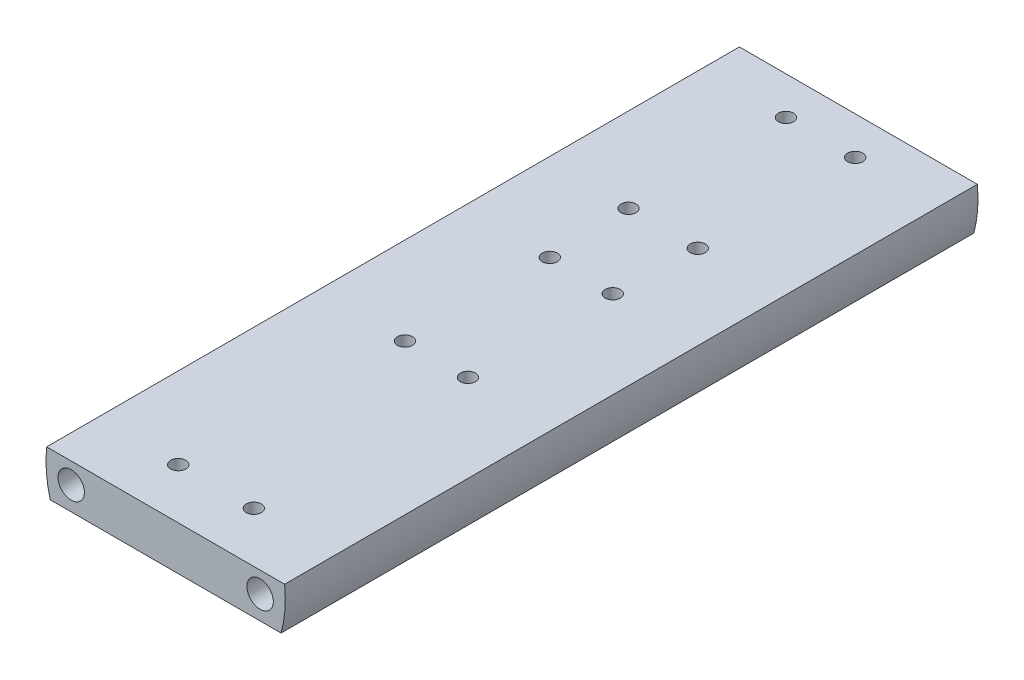
ISO-10303-21;
HEADER;
FILE_DESCRIPTION(('STEP AP214'),'2;1');
FILE_NAME('part.step','',(''),(''),'','','');
FILE_SCHEMA(('AUTOMOTIVE_DESIGN { 1 0 10303 214 1 1 1 1 }'));
ENDSEC;
DATA;
#1=APPLICATION_CONTEXT('core data for automotive mechanical design processes');
#2=APPLICATION_PROTOCOL_DEFINITION('international standard','automotive_design',2000,#1);
#3=PRODUCT_CONTEXT('',#1,'mechanical');
#4=PRODUCT('Part','Part','',(#3));
#5=PRODUCT_RELATED_PRODUCT_CATEGORY('part','',(#4));
#6=PRODUCT_DEFINITION_FORMATION('','',#4);
#7=PRODUCT_DEFINITION_CONTEXT('part definition',#1,'design');
#8=PRODUCT_DEFINITION('design','',#6,#7);
#9=PRODUCT_DEFINITION_SHAPE('','',#8);
#10=(LENGTH_UNIT() NAMED_UNIT(*) SI_UNIT(.MILLI.,.METRE.));
#11=(NAMED_UNIT(*) PLANE_ANGLE_UNIT() SI_UNIT($,.RADIAN.));
#12=(NAMED_UNIT(*) SI_UNIT($,.STERADIAN.) SOLID_ANGLE_UNIT());
#13=UNCERTAINTY_MEASURE_WITH_UNIT(LENGTH_MEASURE(1.E-05),#10,'distance_accuracy_value','');
#14=(GEOMETRIC_REPRESENTATION_CONTEXT(3) GLOBAL_UNCERTAINTY_ASSIGNED_CONTEXT((#13)) GLOBAL_UNIT_ASSIGNED_CONTEXT((#10,
#11,#12)) REPRESENTATION_CONTEXT('',''));
#15=CARTESIAN_POINT('',(0.,0.,0.));
#16=DIRECTION('',(0.,0.,1.));
#17=DIRECTION('',(1.,0.,0.));
#18=AXIS2_PLACEMENT_3D('',#15,#16,#17);
#19=CARTESIAN_POINT('',(0.,-6.35,139.7));
#20=DIRECTION('',(0.,1.,0.));
#21=DIRECTION('',(0.,0.,1.));
#22=AXIS2_PLACEMENT_3D('',#19,#20,#21);
#23=PLANE('',#22);
#24=CARTESIAN_POINT('',(17.7800000000002,-6.35,100.33));
#25=DIRECTION('',(0.,-1.,0.));
#26=DIRECTION('',(0.,0.,-1.));
#27=AXIS2_PLACEMENT_3D('',#24,#25,#26);
#28=CIRCLE('',#27,1.524);
#29=CARTESIAN_POINT('',(17.7800000000002,-6.35,98.806));
#30=VERTEX_POINT('',#29);
#31=EDGE_CURVE('E249',#30,#30,#28,.T.);
#32=ORIENTED_EDGE('',*,*,#31,.F.);
#33=EDGE_LOOP('',(#32));
#34=FACE_BOUND('',#33,.T.);
#35=CARTESIAN_POINT('',(30.4800000000002,-6.35,100.33));
#36=DIRECTION('',(0.,-1.,0.));
#37=DIRECTION('',(0.,0.,-1.));
#38=AXIS2_PLACEMENT_3D('',#35,#36,#37);
#39=CIRCLE('',#38,1.524);
#40=CARTESIAN_POINT('',(30.4800000000002,-6.35,98.806));
#41=VERTEX_POINT('',#40);
#42=EDGE_CURVE('E241',#41,#41,#39,.T.);
#43=ORIENTED_EDGE('',*,*,#42,.F.);
#44=EDGE_LOOP('',(#43));
#45=FACE_BOUND('',#44,.T.);
#46=CARTESIAN_POINT('',(30.48,-6.35,125.73));
#47=DIRECTION('',(0.,-1.,0.));
#48=DIRECTION('',(0.,0.,-1.));
#49=AXIS2_PLACEMENT_3D('',#46,#47,#48);
#50=CIRCLE('',#49,1.524);
#51=CARTESIAN_POINT('',(30.48,-6.35,124.206));
#52=VERTEX_POINT('',#51);
#53=EDGE_CURVE('E233',#52,#52,#50,.T.);
#54=ORIENTED_EDGE('',*,*,#53,.F.);
#55=EDGE_LOOP('',(#54));
#56=FACE_BOUND('',#55,.T.);
#57=CARTESIAN_POINT('',(17.78,-6.35,125.73));
#58=DIRECTION('',(0.,-1.,0.));
#59=DIRECTION('',(0.,0.,-1.));
#60=AXIS2_PLACEMENT_3D('',#57,#58,#59);
#61=CIRCLE('',#60,1.524);
#62=CARTESIAN_POINT('',(17.78,-6.35,124.206));
#63=VERTEX_POINT('',#62);
#64=EDGE_CURVE('E229',#63,#63,#61,.T.);
#65=ORIENTED_EDGE('',*,*,#64,.F.);
#66=EDGE_LOOP('',(#65));
#67=FACE_BOUND('',#66,.T.);
#68=DIRECTION('',(1.,0.,0.));
#69=VECTOR('',#68,1.);
#70=CARTESIAN_POINT('',(0.,-6.35,0.));
#71=LINE('',#70,#69);
#72=CARTESIAN_POINT('',(0.850515469624332,-6.35,0.));
#73=VERTEX_POINT('',#72);
#74=CARTESIAN_POINT('',(47.4094845303757,-6.35,0.));
#75=VERTEX_POINT('',#74);
#76=EDGE_CURVE('E119',#73,#75,#71,.T.);
#77=ORIENTED_EDGE('',*,*,#76,.T.);
#78=DIRECTION('',(0.,0.,-1.));
#79=VECTOR('',#78,1.);
#80=CARTESIAN_POINT('',(47.4094845303757,-6.35,139.7));
#81=LINE('',#80,#79);
#82=CARTESIAN_POINT('',(47.4094845303757,-6.35,139.7));
#83=VERTEX_POINT('',#82);
#84=EDGE_CURVE('E11',#83,#75,#81,.T.);
#85=ORIENTED_EDGE('',*,*,#84,.F.);
#86=DIRECTION('',(1.,0.,0.));
#87=VECTOR('',#86,1.);
#88=CARTESIAN_POINT('',(0.,-6.35,139.7));
#89=LINE('',#88,#87);
#90=CARTESIAN_POINT('',(0.850515469624332,-6.35,139.7));
#91=VERTEX_POINT('',#90);
#92=EDGE_CURVE('E93',#91,#83,#89,.T.);
#93=ORIENTED_EDGE('',*,*,#92,.F.);
#94=DIRECTION('',(0.,0.,-1.));
#95=VECTOR('',#94,1.);
#96=CARTESIAN_POINT('',(0.850515469624332,-6.35,139.7));
#97=LINE('',#96,#95);
#98=EDGE_CURVE('E118',#91,#73,#97,.T.);
#99=ORIENTED_EDGE('',*,*,#98,.T.);
#100=EDGE_LOOP('',(#77,#85,#93,#99));
#101=FACE_BOUND('',#100,.T.);
#102=ADVANCED_FACE('F44',(#34,#45,#56,#67,#101),#23,.F.);
#103=CARTESIAN_POINT('',(24.13,0.,139.7));
#104=DIRECTION('',(0.,0.,-1.));
#105=DIRECTION('',(-1.,0.,0.));
#106=AXIS2_PLACEMENT_3D('',#103,#104,#105);
#107=CYLINDRICAL_SURFACE('',#106,24.13);
#108=CARTESIAN_POINT('',(24.13,0.,0.));
#109=DIRECTION('',(0.,0.,1.));
#110=DIRECTION('',(1.,0.,0.));
#111=AXIS2_PLACEMENT_3D('',#108,#109,#110);
#112=CIRCLE('',#111,24.13);
#113=CARTESIAN_POINT('',(48.1259434071678,2.54,0.));
#114=VERTEX_POINT('',#113);
#115=EDGE_CURVE('E99',#75,#114,#112,.T.);
#116=ORIENTED_EDGE('',*,*,#115,.T.);
#117=DIRECTION('',(0.,0.,-1.));
#118=VECTOR('',#117,1.);
#119=CARTESIAN_POINT('',(48.1259434071678,2.54,139.7));
#120=LINE('',#119,#118);
#121=CARTESIAN_POINT('',(48.1259434071678,2.54,139.7));
#122=VERTEX_POINT('',#121);
#123=EDGE_CURVE('E53',#122,#114,#120,.T.);
#124=ORIENTED_EDGE('',*,*,#123,.F.);
#125=CARTESIAN_POINT('',(24.13,0.,139.7));
#126=DIRECTION('',(0.,0.,1.));
#127=DIRECTION('',(1.,0.,0.));
#128=AXIS2_PLACEMENT_3D('',#125,#126,#127);
#129=CIRCLE('',#128,24.13);
#130=EDGE_CURVE('E87',#83,#122,#129,.T.);
#131=ORIENTED_EDGE('',*,*,#130,.F.);
#132=ORIENTED_EDGE('',*,*,#84,.T.);
#133=EDGE_LOOP('',(#116,#124,#131,#132));
#134=FACE_BOUND('',#133,.T.);
#135=ADVANCED_FACE('F98',(#134),#107,.T.);
#136=CARTESIAN_POINT('',(0.,2.54,139.7));
#137=DIRECTION('',(0.,1.,0.));
#138=DIRECTION('',(0.,0.,1.));
#139=AXIS2_PLACEMENT_3D('',#136,#137,#138);
#140=PLANE('',#139);
#141=CARTESIAN_POINT('',(17.7800000000003,2.54,85.09));
#142=DIRECTION('',(0.,1.,0.));
#143=DIRECTION('',(0.,0.,1.));
#144=AXIS2_PLACEMENT_3D('',#141,#142,#143);
#145=CIRCLE('',#144,1.524);
#146=CARTESIAN_POINT('',(17.7800000000003,2.54,86.614));
#147=VERTEX_POINT('',#146);
#148=EDGE_CURVE('E209',#147,#147,#145,.T.);
#149=ORIENTED_EDGE('',*,*,#148,.F.);
#150=EDGE_LOOP('',(#149));
#151=FACE_BOUND('',#150,.T.);
#152=CARTESIAN_POINT('',(30.4800000000003,2.54,85.09));
#153=DIRECTION('',(0.,1.,0.));
#154=DIRECTION('',(0.,0.,1.));
#155=AXIS2_PLACEMENT_3D('',#152,#153,#154);
#156=CIRCLE('',#155,1.52400000000001);
#157=CARTESIAN_POINT('',(30.4800000000003,2.54,86.614));
#158=VERTEX_POINT('',#157);
#159=EDGE_CURVE('E201',#158,#158,#156,.T.);
#160=ORIENTED_EDGE('',*,*,#159,.F.);
#161=EDGE_LOOP('',(#160));
#162=FACE_BOUND('',#161,.T.);
#163=CARTESIAN_POINT('',(30.48,2.54,55.88));
#164=DIRECTION('',(0.,1.,0.));
#165=DIRECTION('',(0.,0.,1.));
#166=AXIS2_PLACEMENT_3D('',#163,#164,#165);
#167=CIRCLE('',#166,1.52400000000001);
#168=CARTESIAN_POINT('',(30.48,2.54,57.404));
#169=VERTEX_POINT('',#168);
#170=EDGE_CURVE('E193',#169,#169,#167,.T.);
#171=ORIENTED_EDGE('',*,*,#170,.F.);
#172=EDGE_LOOP('',(#171));
#173=FACE_BOUND('',#172,.T.);
#174=CARTESIAN_POINT('',(17.1450000000003,2.54,39.37));
#175=DIRECTION('',(0.,1.,0.));
#176=DIRECTION('',(0.,0.,1.));
#177=AXIS2_PLACEMENT_3D('',#174,#175,#176);
#178=CIRCLE('',#177,1.524);
#179=CARTESIAN_POINT('',(17.1450000000003,2.54,40.894));
#180=VERTEX_POINT('',#179);
#181=EDGE_CURVE('E185',#180,#180,#178,.T.);
#182=ORIENTED_EDGE('',*,*,#181,.F.);
#183=EDGE_LOOP('',(#182));
#184=FACE_BOUND('',#183,.T.);
#185=CARTESIAN_POINT('',(31.1150000000003,2.54,39.37));
#186=DIRECTION('',(0.,1.,0.));
#187=DIRECTION('',(0.,0.,1.));
#188=AXIS2_PLACEMENT_3D('',#185,#186,#187);
#189=CIRCLE('',#188,1.524);
#190=CARTESIAN_POINT('',(31.1150000000003,2.54,40.894));
#191=VERTEX_POINT('',#190);
#192=EDGE_CURVE('E177',#191,#191,#189,.T.);
#193=ORIENTED_EDGE('',*,*,#192,.F.);
#194=EDGE_LOOP('',(#193));
#195=FACE_BOUND('',#194,.T.);
#196=CARTESIAN_POINT('',(31.115,2.54,7.62));
#197=DIRECTION('',(0.,1.,0.));
#198=DIRECTION('',(0.,0.,1.));
#199=AXIS2_PLACEMENT_3D('',#196,#197,#198);
#200=CIRCLE('',#199,1.52400000000001);
#201=CARTESIAN_POINT('',(31.115,2.54,9.144));
#202=VERTEX_POINT('',#201);
#203=EDGE_CURVE('E169',#202,#202,#200,.T.);
#204=ORIENTED_EDGE('',*,*,#203,.F.);
#205=EDGE_LOOP('',(#204));
#206=FACE_BOUND('',#205,.T.);
#207=CARTESIAN_POINT('',(16.5100000000003,2.54,129.54));
#208=DIRECTION('',(0.,1.,0.));
#209=DIRECTION('',(0.,0.,1.));
#210=AXIS2_PLACEMENT_3D('',#207,#208,#209);
#211=CIRCLE('',#210,1.524);
#212=CARTESIAN_POINT('',(16.5100000000003,2.54,131.064));
#213=VERTEX_POINT('',#212);
#214=EDGE_CURVE('E161',#213,#213,#211,.T.);
#215=ORIENTED_EDGE('',*,*,#214,.F.);
#216=EDGE_LOOP('',(#215));
#217=FACE_BOUND('',#216,.T.);
#218=CARTESIAN_POINT('',(17.78,2.54,55.88));
#219=DIRECTION('',(0.,1.,0.));
#220=DIRECTION('',(0.,0.,1.));
#221=AXIS2_PLACEMENT_3D('',#218,#219,#220);
#222=CIRCLE('',#221,1.524);
#223=CARTESIAN_POINT('',(17.78,2.54,57.404));
#224=VERTEX_POINT('',#223);
#225=EDGE_CURVE('E153',#224,#224,#222,.T.);
#226=ORIENTED_EDGE('',*,*,#225,.F.);
#227=EDGE_LOOP('',(#226));
#228=FACE_BOUND('',#227,.T.);
#229=CARTESIAN_POINT('',(31.7500000000003,2.54,129.54));
#230=DIRECTION('',(0.,1.,0.));
#231=DIRECTION('',(0.,0.,1.));
#232=AXIS2_PLACEMENT_3D('',#229,#230,#231);
#233=CIRCLE('',#232,1.524);
#234=CARTESIAN_POINT('',(31.7500000000003,2.54,131.064));
#235=VERTEX_POINT('',#234);
#236=EDGE_CURVE('E217',#235,#235,#233,.T.);
#237=ORIENTED_EDGE('',*,*,#236,.F.);
#238=EDGE_LOOP('',(#237));
#239=FACE_BOUND('',#238,.T.);
#240=CARTESIAN_POINT('',(17.145,2.54,7.62));
#241=DIRECTION('',(0.,1.,0.));
#242=DIRECTION('',(0.,0.,1.));
#243=AXIS2_PLACEMENT_3D('',#240,#241,#242);
#244=CIRCLE('',#243,1.524);
#245=CARTESIAN_POINT('',(17.145,2.54,9.14399999999999));
#246=VERTEX_POINT('',#245);
#247=EDGE_CURVE('E149',#246,#246,#244,.T.);
#248=ORIENTED_EDGE('',*,*,#247,.F.);
#249=EDGE_LOOP('',(#248));
#250=FACE_BOUND('',#249,.T.);
#251=DIRECTION('',(1.,0.,0.));
#252=VECTOR('',#251,1.);
#253=CARTESIAN_POINT('',(0.,2.54,0.));
#254=LINE('',#253,#252);
#255=CARTESIAN_POINT('',(0.134056592832194,2.54,0.));
#256=VERTEX_POINT('',#255);
#257=EDGE_CURVE('E126',#256,#114,#254,.T.);
#258=ORIENTED_EDGE('',*,*,#257,.F.);
#259=DIRECTION('',(0.,0.,-1.));
#260=VECTOR('',#259,1.);
#261=CARTESIAN_POINT('',(0.134056592832194,2.54,139.7));
#262=LINE('',#261,#260);
#263=CARTESIAN_POINT('',(0.134056592832194,2.54,139.7));
#264=VERTEX_POINT('',#263);
#265=EDGE_CURVE('E77',#264,#256,#262,.T.);
#266=ORIENTED_EDGE('',*,*,#265,.F.);
#267=DIRECTION('',(1.,0.,0.));
#268=VECTOR('',#267,1.);
#269=CARTESIAN_POINT('',(0.,2.54,139.7));
#270=LINE('',#269,#268);
#271=EDGE_CURVE('E91',#264,#122,#270,.T.);
#272=ORIENTED_EDGE('',*,*,#271,.T.);
#273=ORIENTED_EDGE('',*,*,#123,.T.);
#274=EDGE_LOOP('',(#258,#266,#272,#273));
#275=FACE_BOUND('',#274,.T.);
#276=ADVANCED_FACE('F104',(#151,#162,#173,#184,#195,#206,#217,#228,#239,#250,#275),#140,.T.);
#277=CARTESIAN_POINT('',(5.08,-1.63488750906681,139.7));
#278=DIRECTION('',(0.,0.,-1.));
#279=DIRECTION('',(-1.,0.,0.));
#280=AXIS2_PLACEMENT_3D('',#277,#278,#279);
#281=CYLINDRICAL_SURFACE('',#280,2.667);
#282=CARTESIAN_POINT('',(5.08,-1.63488750906681,139.7));
#283=DIRECTION('',(0.,0.,1.));
#284=DIRECTION('',(1.,0.,0.));
#285=AXIS2_PLACEMENT_3D('',#282,#283,#284);
#286=CIRCLE('',#285,2.667);
#287=CARTESIAN_POINT('',(7.747,-1.63488750906681,139.7));
#288=VERTEX_POINT('',#287);
#289=EDGE_CURVE('E108',#288,#288,#286,.T.);
#290=ORIENTED_EDGE('',*,*,#289,.T.);
#291=EDGE_LOOP('',(#290));
#292=FACE_BOUND('',#291,.T.);
#293=CARTESIAN_POINT('',(5.08,-1.63488750906681,0.));
#294=DIRECTION('',(0.,0.,1.));
#295=DIRECTION('',(1.,0.,0.));
#296=AXIS2_PLACEMENT_3D('',#293,#294,#295);
#297=CIRCLE('',#296,2.667);
#298=CARTESIAN_POINT('',(7.747,-1.63488750906681,0.));
#299=VERTEX_POINT('',#298);
#300=EDGE_CURVE('E129',#299,#299,#297,.T.);
#301=ORIENTED_EDGE('',*,*,#300,.F.);
#302=EDGE_LOOP('',(#301));
#303=FACE_BOUND('',#302,.T.);
#304=ADVANCED_FACE('F380',(#292,#303),#281,.F.);
#305=EDGE_CURVE('E80',#256,#73,#112,.T.);
#306=ORIENTED_EDGE('',*,*,#305,.T.);
#307=ORIENTED_EDGE('',*,*,#98,.F.);
#308=EDGE_CURVE('E61',#264,#91,#129,.T.);
#309=ORIENTED_EDGE('',*,*,#308,.F.);
#310=ORIENTED_EDGE('',*,*,#265,.T.);
#311=EDGE_LOOP('',(#306,#307,#309,#310));
#312=FACE_BOUND('',#311,.T.);
#313=ADVANCED_FACE('F378',(#312),#107,.T.);
#314=CARTESIAN_POINT('',(43.18,-1.63488750906681,139.7));
#315=DIRECTION('',(0.,0.,-1.));
#316=DIRECTION('',(-1.,0.,0.));
#317=AXIS2_PLACEMENT_3D('',#314,#315,#316);
#318=CYLINDRICAL_SURFACE('',#317,2.667);
#319=CARTESIAN_POINT('',(43.18,-1.63488750906681,139.7));
#320=DIRECTION('',(0.,0.,1.));
#321=DIRECTION('',(1.,0.,0.));
#322=AXIS2_PLACEMENT_3D('',#319,#320,#321);
#323=CIRCLE('',#322,2.667);
#324=CARTESIAN_POINT('',(45.847,-1.63488750906681,139.7));
#325=VERTEX_POINT('',#324);
#326=EDGE_CURVE('E114',#325,#325,#323,.T.);
#327=ORIENTED_EDGE('',*,*,#326,.T.);
#328=EDGE_LOOP('',(#327));
#329=FACE_BOUND('',#328,.T.);
#330=CARTESIAN_POINT('',(43.18,-1.63488750906681,0.));
#331=DIRECTION('',(0.,0.,1.));
#332=DIRECTION('',(1.,0.,0.));
#333=AXIS2_PLACEMENT_3D('',#330,#331,#332);
#334=CIRCLE('',#333,2.667);
#335=CARTESIAN_POINT('',(45.847,-1.63488750906681,0.));
#336=VERTEX_POINT('',#335);
#337=EDGE_CURVE('E133',#336,#336,#334,.T.);
#338=ORIENTED_EDGE('',*,*,#337,.F.);
#339=EDGE_LOOP('',(#338));
#340=FACE_BOUND('',#339,.T.);
#341=ADVANCED_FACE('F373',(#329,#340),#318,.F.);
#342=CARTESIAN_POINT('',(0.,0.,139.7));
#343=DIRECTION('',(0.,0.,1.));
#344=DIRECTION('',(1.,0.,0.));
#345=AXIS2_PLACEMENT_3D('',#342,#343,#344);
#346=PLANE('',#345);
#347=ORIENTED_EDGE('',*,*,#92,.T.);
#348=ORIENTED_EDGE('',*,*,#130,.T.);
#349=ORIENTED_EDGE('',*,*,#271,.F.);
#350=ORIENTED_EDGE('',*,*,#308,.T.);
#351=EDGE_LOOP('',(#347,#348,#349,#350));
#352=FACE_BOUND('',#351,.T.);
#353=ORIENTED_EDGE('',*,*,#289,.F.);
#354=EDGE_LOOP('',(#353));
#355=FACE_BOUND('',#354,.T.);
#356=ORIENTED_EDGE('',*,*,#326,.F.);
#357=EDGE_LOOP('',(#356));
#358=FACE_BOUND('',#357,.T.);
#359=ADVANCED_FACE('F88',(#352,#355,#358),#346,.T.);
#360=CARTESIAN_POINT('',(0.,0.,0.));
#361=DIRECTION('',(0.,0.,1.));
#362=DIRECTION('',(1.,0.,0.));
#363=AXIS2_PLACEMENT_3D('',#360,#361,#362);
#364=PLANE('',#363);
#365=ORIENTED_EDGE('',*,*,#76,.F.);
#366=ORIENTED_EDGE('',*,*,#305,.F.);
#367=ORIENTED_EDGE('',*,*,#257,.T.);
#368=ORIENTED_EDGE('',*,*,#115,.F.);
#369=EDGE_LOOP('',(#365,#366,#367,#368));
#370=FACE_BOUND('',#369,.T.);
#371=ORIENTED_EDGE('',*,*,#300,.T.);
#372=EDGE_LOOP('',(#371));
#373=FACE_BOUND('',#372,.T.);
#374=ORIENTED_EDGE('',*,*,#337,.T.);
#375=EDGE_LOOP('',(#374));
#376=FACE_BOUND('',#375,.T.);
#377=ADVANCED_FACE('F143',(#370,#373,#376),#364,.F.);
#378=CARTESIAN_POINT('',(17.145,-2.54,7.62));
#379=DIRECTION('',(0.,1.,0.));
#380=DIRECTION('',(0.,0.,1.));
#381=AXIS2_PLACEMENT_3D('',#378,#379,#380);
#382=CYLINDRICAL_SURFACE('',#381,1.524);
#383=CARTESIAN_POINT('',(17.145,-2.54,7.62));
#384=DIRECTION('',(0.,1.,0.));
#385=DIRECTION('',(0.,0.,1.));
#386=AXIS2_PLACEMENT_3D('',#383,#384,#385);
#387=CIRCLE('',#386,1.524);
#388=CARTESIAN_POINT('',(17.145,-2.54,9.14399999999999));
#389=VERTEX_POINT('',#388);
#390=EDGE_CURVE('E123',#389,#389,#387,.T.);
#391=ORIENTED_EDGE('',*,*,#390,.F.);
#392=EDGE_LOOP('',(#391));
#393=FACE_BOUND('',#392,.T.);
#394=ORIENTED_EDGE('',*,*,#247,.T.);
#395=EDGE_LOOP('',(#394));
#396=FACE_BOUND('',#395,.T.);
#397=ADVANCED_FACE('F366',(#393,#396),#382,.F.);
#398=CARTESIAN_POINT('',(17.145,-2.54,7.62));
#399=DIRECTION('',(0.,1.,0.));
#400=DIRECTION('',(0.,0.,1.));
#401=AXIS2_PLACEMENT_3D('',#398,#399,#400);
#402=PLANE('',#401);
#403=ORIENTED_EDGE('',*,*,#390,.T.);
#404=EDGE_LOOP('',(#403));
#405=FACE_BOUND('',#404,.T.);
#406=ADVANCED_FACE('F300',(#405),#402,.T.);
#407=CARTESIAN_POINT('',(31.7500000000003,-2.54,129.54));
#408=DIRECTION('',(0.,1.,0.));
#409=DIRECTION('',(0.,0.,1.));
#410=AXIS2_PLACEMENT_3D('',#407,#408,#409);
#411=CYLINDRICAL_SURFACE('',#410,1.524);
#412=CARTESIAN_POINT('',(31.7500000000003,-2.54,129.54));
#413=DIRECTION('',(0.,1.,0.));
#414=DIRECTION('',(0.,0.,1.));
#415=AXIS2_PLACEMENT_3D('',#412,#413,#414);
#416=CIRCLE('',#415,1.524);
#417=CARTESIAN_POINT('',(31.7500000000003,-2.54,131.064));
#418=VERTEX_POINT('',#417);
#419=EDGE_CURVE('E221',#418,#418,#416,.T.);
#420=ORIENTED_EDGE('',*,*,#419,.F.);
#421=EDGE_LOOP('',(#420));
#422=FACE_BOUND('',#421,.T.);
#423=ORIENTED_EDGE('',*,*,#236,.T.);
#424=EDGE_LOOP('',(#423));
#425=FACE_BOUND('',#424,.T.);
#426=ADVANCED_FACE('F296',(#422,#425),#411,.F.);
#427=CARTESIAN_POINT('',(31.7500000000003,-2.54,129.54));
#428=DIRECTION('',(0.,1.,0.));
#429=DIRECTION('',(0.,0.,1.));
#430=AXIS2_PLACEMENT_3D('',#427,#428,#429);
#431=PLANE('',#430);
#432=ORIENTED_EDGE('',*,*,#419,.T.);
#433=EDGE_LOOP('',(#432));
#434=FACE_BOUND('',#433,.T.);
#435=ADVANCED_FACE('F299',(#434),#431,.T.);
#436=CARTESIAN_POINT('',(17.78,-2.54,55.88));
#437=DIRECTION('',(0.,1.,0.));
#438=DIRECTION('',(0.,0.,1.));
#439=AXIS2_PLACEMENT_3D('',#436,#437,#438);
#440=CYLINDRICAL_SURFACE('',#439,1.524);
#441=CARTESIAN_POINT('',(17.78,-2.54,55.88));
#442=DIRECTION('',(0.,1.,0.));
#443=DIRECTION('',(0.,0.,1.));
#444=AXIS2_PLACEMENT_3D('',#441,#442,#443);
#445=CIRCLE('',#444,1.524);
#446=CARTESIAN_POINT('',(17.78,-2.54,57.404));
#447=VERTEX_POINT('',#446);
#448=EDGE_CURVE('E157',#447,#447,#445,.T.);
#449=ORIENTED_EDGE('',*,*,#448,.F.);
#450=EDGE_LOOP('',(#449));
#451=FACE_BOUND('',#450,.T.);
#452=ORIENTED_EDGE('',*,*,#225,.T.);
#453=EDGE_LOOP('',(#452));
#454=FACE_BOUND('',#453,.T.);
#455=ADVANCED_FACE('F304',(#451,#454),#440,.F.);
#456=CARTESIAN_POINT('',(17.78,-2.54,55.88));
#457=DIRECTION('',(0.,1.,0.));
#458=DIRECTION('',(0.,0.,1.));
#459=AXIS2_PLACEMENT_3D('',#456,#457,#458);
#460=PLANE('',#459);
#461=ORIENTED_EDGE('',*,*,#448,.T.);
#462=EDGE_LOOP('',(#461));
#463=FACE_BOUND('',#462,.T.);
#464=ADVANCED_FACE('F336',(#463),#460,.T.);
#465=CARTESIAN_POINT('',(16.5100000000003,-2.54,129.54));
#466=DIRECTION('',(0.,1.,0.));
#467=DIRECTION('',(0.,0.,1.));
#468=AXIS2_PLACEMENT_3D('',#465,#466,#467);
#469=CYLINDRICAL_SURFACE('',#468,1.524);
#470=CARTESIAN_POINT('',(16.5100000000003,-2.54,129.54));
#471=DIRECTION('',(0.,1.,0.));
#472=DIRECTION('',(0.,0.,1.));
#473=AXIS2_PLACEMENT_3D('',#470,#471,#472);
#474=CIRCLE('',#473,1.524);
#475=CARTESIAN_POINT('',(16.5100000000003,-2.54,131.064));
#476=VERTEX_POINT('',#475);
#477=EDGE_CURVE('E165',#476,#476,#474,.T.);
#478=ORIENTED_EDGE('',*,*,#477,.F.);
#479=EDGE_LOOP('',(#478));
#480=FACE_BOUND('',#479,.T.);
#481=ORIENTED_EDGE('',*,*,#214,.T.);
#482=EDGE_LOOP('',(#481));
#483=FACE_BOUND('',#482,.T.);
#484=ADVANCED_FACE('F340',(#480,#483),#469,.F.);
#485=CARTESIAN_POINT('',(16.5100000000003,-2.54,129.54));
#486=DIRECTION('',(0.,1.,0.));
#487=DIRECTION('',(0.,0.,1.));
#488=AXIS2_PLACEMENT_3D('',#485,#486,#487);
#489=PLANE('',#488);
#490=ORIENTED_EDGE('',*,*,#477,.T.);
#491=EDGE_LOOP('',(#490));
#492=FACE_BOUND('',#491,.T.);
#493=ADVANCED_FACE('F344',(#492),#489,.T.);
#494=CARTESIAN_POINT('',(31.115,-2.54,7.62));
#495=DIRECTION('',(0.,1.,0.));
#496=DIRECTION('',(0.,0.,1.));
#497=AXIS2_PLACEMENT_3D('',#494,#495,#496);
#498=CYLINDRICAL_SURFACE('',#497,1.52400000000001);
#499=CARTESIAN_POINT('',(31.115,-2.54,7.62));
#500=DIRECTION('',(0.,1.,0.));
#501=DIRECTION('',(0.,0.,1.));
#502=AXIS2_PLACEMENT_3D('',#499,#500,#501);
#503=CIRCLE('',#502,1.52400000000001);
#504=CARTESIAN_POINT('',(31.115,-2.54,9.144));
#505=VERTEX_POINT('',#504);
#506=EDGE_CURVE('E173',#505,#505,#503,.T.);
#507=ORIENTED_EDGE('',*,*,#506,.F.);
#508=EDGE_LOOP('',(#507));
#509=FACE_BOUND('',#508,.T.);
#510=ORIENTED_EDGE('',*,*,#203,.T.);
#511=EDGE_LOOP('',(#510));
#512=FACE_BOUND('',#511,.T.);
#513=ADVANCED_FACE('F348',(#509,#512),#498,.F.);
#514=CARTESIAN_POINT('',(31.115,-2.54,7.62));
#515=DIRECTION('',(0.,1.,0.));
#516=DIRECTION('',(0.,0.,1.));
#517=AXIS2_PLACEMENT_3D('',#514,#515,#516);
#518=PLANE('',#517);
#519=ORIENTED_EDGE('',*,*,#506,.T.);
#520=EDGE_LOOP('',(#519));
#521=FACE_BOUND('',#520,.T.);
#522=ADVANCED_FACE('F352',(#521),#518,.T.);
#523=CARTESIAN_POINT('',(31.1150000000003,-2.54,39.37));
#524=DIRECTION('',(0.,1.,0.));
#525=DIRECTION('',(0.,0.,1.));
#526=AXIS2_PLACEMENT_3D('',#523,#524,#525);
#527=CYLINDRICAL_SURFACE('',#526,1.524);
#528=CARTESIAN_POINT('',(31.1150000000003,-2.54,39.37));
#529=DIRECTION('',(0.,1.,0.));
#530=DIRECTION('',(0.,0.,1.));
#531=AXIS2_PLACEMENT_3D('',#528,#529,#530);
#532=CIRCLE('',#531,1.524);
#533=CARTESIAN_POINT('',(31.1150000000003,-2.54,40.894));
#534=VERTEX_POINT('',#533);
#535=EDGE_CURVE('E181',#534,#534,#532,.T.);
#536=ORIENTED_EDGE('',*,*,#535,.F.);
#537=EDGE_LOOP('',(#536));
#538=FACE_BOUND('',#537,.T.);
#539=ORIENTED_EDGE('',*,*,#192,.T.);
#540=EDGE_LOOP('',(#539));
#541=FACE_BOUND('',#540,.T.);
#542=ADVANCED_FACE('F356',(#538,#541),#527,.F.);
#543=CARTESIAN_POINT('',(31.1150000000003,-2.54,39.37));
#544=DIRECTION('',(0.,1.,0.));
#545=DIRECTION('',(0.,0.,1.));
#546=AXIS2_PLACEMENT_3D('',#543,#544,#545);
#547=PLANE('',#546);
#548=ORIENTED_EDGE('',*,*,#535,.T.);
#549=EDGE_LOOP('',(#548));
#550=FACE_BOUND('',#549,.T.);
#551=ADVANCED_FACE('F310',(#550),#547,.T.);
#552=CARTESIAN_POINT('',(17.1450000000003,-2.54,39.37));
#553=DIRECTION('',(0.,1.,0.));
#554=DIRECTION('',(0.,0.,1.));
#555=AXIS2_PLACEMENT_3D('',#552,#553,#554);
#556=CYLINDRICAL_SURFACE('',#555,1.524);
#557=CARTESIAN_POINT('',(17.1450000000003,-2.54,39.37));
#558=DIRECTION('',(0.,1.,0.));
#559=DIRECTION('',(0.,0.,1.));
#560=AXIS2_PLACEMENT_3D('',#557,#558,#559);
#561=CIRCLE('',#560,1.524);
#562=CARTESIAN_POINT('',(17.1450000000003,-2.54,40.894));
#563=VERTEX_POINT('',#562);
#564=EDGE_CURVE('E189',#563,#563,#561,.T.);
#565=ORIENTED_EDGE('',*,*,#564,.F.);
#566=EDGE_LOOP('',(#565));
#567=FACE_BOUND('',#566,.T.);
#568=ORIENTED_EDGE('',*,*,#181,.T.);
#569=EDGE_LOOP('',(#568));
#570=FACE_BOUND('',#569,.T.);
#571=ADVANCED_FACE('F306',(#567,#570),#556,.F.);
#572=CARTESIAN_POINT('',(17.1450000000003,-2.54,39.37));
#573=DIRECTION('',(0.,1.,0.));
#574=DIRECTION('',(0.,0.,1.));
#575=AXIS2_PLACEMENT_3D('',#572,#573,#574);
#576=PLANE('',#575);
#577=ORIENTED_EDGE('',*,*,#564,.T.);
#578=EDGE_LOOP('',(#577));
#579=FACE_BOUND('',#578,.T.);
#580=ADVANCED_FACE('F309',(#579),#576,.T.);
#581=CARTESIAN_POINT('',(30.48,-2.54,55.88));
#582=DIRECTION('',(0.,1.,0.));
#583=DIRECTION('',(0.,0.,1.));
#584=AXIS2_PLACEMENT_3D('',#581,#582,#583);
#585=CYLINDRICAL_SURFACE('',#584,1.52400000000001);
#586=CARTESIAN_POINT('',(30.48,-2.54,55.88));
#587=DIRECTION('',(0.,1.,0.));
#588=DIRECTION('',(0.,0.,1.));
#589=AXIS2_PLACEMENT_3D('',#586,#587,#588);
#590=CIRCLE('',#589,1.52400000000001);
#591=CARTESIAN_POINT('',(30.48,-2.54,57.404));
#592=VERTEX_POINT('',#591);
#593=EDGE_CURVE('E197',#592,#592,#590,.T.);
#594=ORIENTED_EDGE('',*,*,#593,.F.);
#595=EDGE_LOOP('',(#594));
#596=FACE_BOUND('',#595,.T.);
#597=ORIENTED_EDGE('',*,*,#170,.T.);
#598=EDGE_LOOP('',(#597));
#599=FACE_BOUND('',#598,.T.);
#600=ADVANCED_FACE('F314',(#596,#599),#585,.F.);
#601=CARTESIAN_POINT('',(30.48,-2.54,55.88));
#602=DIRECTION('',(0.,1.,0.));
#603=DIRECTION('',(0.,0.,1.));
#604=AXIS2_PLACEMENT_3D('',#601,#602,#603);
#605=PLANE('',#604);
#606=ORIENTED_EDGE('',*,*,#593,.T.);
#607=EDGE_LOOP('',(#606));
#608=FACE_BOUND('',#607,.T.);
#609=ADVANCED_FACE('F318',(#608),#605,.T.);
#610=CARTESIAN_POINT('',(30.4800000000003,-2.54,85.09));
#611=DIRECTION('',(0.,1.,0.));
#612=DIRECTION('',(0.,0.,1.));
#613=AXIS2_PLACEMENT_3D('',#610,#611,#612);
#614=CYLINDRICAL_SURFACE('',#613,1.52400000000001);
#615=CARTESIAN_POINT('',(30.4800000000003,-2.54,85.09));
#616=DIRECTION('',(0.,1.,0.));
#617=DIRECTION('',(0.,0.,1.));
#618=AXIS2_PLACEMENT_3D('',#615,#616,#617);
#619=CIRCLE('',#618,1.52400000000001);
#620=CARTESIAN_POINT('',(30.4800000000003,-2.54,86.614));
#621=VERTEX_POINT('',#620);
#622=EDGE_CURVE('E205',#621,#621,#619,.T.);
#623=ORIENTED_EDGE('',*,*,#622,.F.);
#624=EDGE_LOOP('',(#623));
#625=FACE_BOUND('',#624,.T.);
#626=ORIENTED_EDGE('',*,*,#159,.T.);
#627=EDGE_LOOP('',(#626));
#628=FACE_BOUND('',#627,.T.);
#629=ADVANCED_FACE('F322',(#625,#628),#614,.F.);
#630=CARTESIAN_POINT('',(30.4800000000003,-2.54,85.09));
#631=DIRECTION('',(0.,1.,0.));
#632=DIRECTION('',(0.,0.,1.));
#633=AXIS2_PLACEMENT_3D('',#630,#631,#632);
#634=PLANE('',#633);
#635=ORIENTED_EDGE('',*,*,#622,.T.);
#636=EDGE_LOOP('',(#635));
#637=FACE_BOUND('',#636,.T.);
#638=ADVANCED_FACE('F326',(#637),#634,.T.);
#639=CARTESIAN_POINT('',(17.7800000000003,-2.54,85.09));
#640=DIRECTION('',(0.,1.,0.));
#641=DIRECTION('',(0.,0.,1.));
#642=AXIS2_PLACEMENT_3D('',#639,#640,#641);
#643=CYLINDRICAL_SURFACE('',#642,1.524);
#644=CARTESIAN_POINT('',(17.7800000000003,-2.54,85.09));
#645=DIRECTION('',(0.,1.,0.));
#646=DIRECTION('',(0.,0.,1.));
#647=AXIS2_PLACEMENT_3D('',#644,#645,#646);
#648=CIRCLE('',#647,1.524);
#649=CARTESIAN_POINT('',(17.7800000000003,-2.54,86.614));
#650=VERTEX_POINT('',#649);
#651=EDGE_CURVE('E213',#650,#650,#648,.T.);
#652=ORIENTED_EDGE('',*,*,#651,.F.);
#653=EDGE_LOOP('',(#652));
#654=FACE_BOUND('',#653,.T.);
#655=ORIENTED_EDGE('',*,*,#148,.T.);
#656=EDGE_LOOP('',(#655));
#657=FACE_BOUND('',#656,.T.);
#658=ADVANCED_FACE('F290',(#654,#657),#643,.F.);
#659=CARTESIAN_POINT('',(17.7800000000003,-2.54,85.09));
#660=DIRECTION('',(0.,1.,0.));
#661=DIRECTION('',(0.,0.,1.));
#662=AXIS2_PLACEMENT_3D('',#659,#660,#661);
#663=PLANE('',#662);
#664=ORIENTED_EDGE('',*,*,#651,.T.);
#665=EDGE_LOOP('',(#664));
#666=FACE_BOUND('',#665,.T.);
#667=ADVANCED_FACE('F280',(#666),#663,.T.);
#668=CARTESIAN_POINT('',(17.78,-1.27,125.73));
#669=DIRECTION('',(0.,-1.,0.));
#670=DIRECTION('',(0.,0.,-1.));
#671=AXIS2_PLACEMENT_3D('',#668,#669,#670);
#672=CYLINDRICAL_SURFACE('',#671,1.524);
#673=CARTESIAN_POINT('',(17.78,-1.27,125.73));
#674=DIRECTION('',(0.,-1.,0.));
#675=DIRECTION('',(0.,0.,-1.));
#676=AXIS2_PLACEMENT_3D('',#673,#674,#675);
#677=CIRCLE('',#676,1.524);
#678=CARTESIAN_POINT('',(17.78,-1.27,124.206));
#679=VERTEX_POINT('',#678);
#680=EDGE_CURVE('E225',#679,#679,#677,.T.);
#681=ORIENTED_EDGE('',*,*,#680,.F.);
#682=EDGE_LOOP('',(#681));
#683=FACE_BOUND('',#682,.T.);
#684=ORIENTED_EDGE('',*,*,#64,.T.);
#685=EDGE_LOOP('',(#684));
#686=FACE_BOUND('',#685,.T.);
#687=ADVANCED_FACE('F277',(#683,#686),#672,.F.);
#688=CARTESIAN_POINT('',(17.78,-1.27,125.73));
#689=DIRECTION('',(0.,-1.,0.));
#690=DIRECTION('',(0.,0.,-1.));
#691=AXIS2_PLACEMENT_3D('',#688,#689,#690);
#692=PLANE('',#691);
#693=ORIENTED_EDGE('',*,*,#680,.T.);
#694=EDGE_LOOP('',(#693));
#695=FACE_BOUND('',#694,.T.);
#696=ADVANCED_FACE('F279',(#695),#692,.T.);
#697=CARTESIAN_POINT('',(30.48,-1.27,125.73));
#698=DIRECTION('',(0.,-1.,0.));
#699=DIRECTION('',(0.,0.,-1.));
#700=AXIS2_PLACEMENT_3D('',#697,#698,#699);
#701=CYLINDRICAL_SURFACE('',#700,1.524);
#702=CARTESIAN_POINT('',(30.48,-1.27,125.73));
#703=DIRECTION('',(0.,-1.,0.));
#704=DIRECTION('',(0.,0.,-1.));
#705=AXIS2_PLACEMENT_3D('',#702,#703,#704);
#706=CIRCLE('',#705,1.524);
#707=CARTESIAN_POINT('',(30.48,-1.27,124.206));
#708=VERTEX_POINT('',#707);
#709=EDGE_CURVE('E237',#708,#708,#706,.T.);
#710=ORIENTED_EDGE('',*,*,#709,.F.);
#711=EDGE_LOOP('',(#710));
#712=FACE_BOUND('',#711,.T.);
#713=ORIENTED_EDGE('',*,*,#53,.T.);
#714=EDGE_LOOP('',(#713));
#715=FACE_BOUND('',#714,.T.);
#716=ADVANCED_FACE('F287',(#712,#715),#701,.F.);
#717=CARTESIAN_POINT('',(30.48,-1.27,125.73));
#718=DIRECTION('',(0.,-1.,0.));
#719=DIRECTION('',(0.,0.,-1.));
#720=AXIS2_PLACEMENT_3D('',#717,#718,#719);
#721=PLANE('',#720);
#722=ORIENTED_EDGE('',*,*,#709,.T.);
#723=EDGE_LOOP('',(#722));
#724=FACE_BOUND('',#723,.T.);
#725=ADVANCED_FACE('F452',(#724),#721,.T.);
#726=CARTESIAN_POINT('',(30.4800000000002,-1.27,100.33));
#727=DIRECTION('',(0.,-1.,0.));
#728=DIRECTION('',(0.,0.,-1.));
#729=AXIS2_PLACEMENT_3D('',#726,#727,#728);
#730=CYLINDRICAL_SURFACE('',#729,1.524);
#731=CARTESIAN_POINT('',(30.4800000000002,-1.27,100.33));
#732=DIRECTION('',(0.,-1.,0.));
#733=DIRECTION('',(0.,0.,-1.));
#734=AXIS2_PLACEMENT_3D('',#731,#732,#733);
#735=CIRCLE('',#734,1.524);
#736=CARTESIAN_POINT('',(30.4800000000002,-1.27,98.806));
#737=VERTEX_POINT('',#736);
#738=EDGE_CURVE('E245',#737,#737,#735,.T.);
#739=ORIENTED_EDGE('',*,*,#738,.F.);
#740=EDGE_LOOP('',(#739));
#741=FACE_BOUND('',#740,.T.);
#742=ORIENTED_EDGE('',*,*,#42,.T.);
#743=EDGE_LOOP('',(#742));
#744=FACE_BOUND('',#743,.T.);
#745=ADVANCED_FACE('F463',(#741,#744),#730,.F.);
#746=CARTESIAN_POINT('',(30.4800000000002,-1.27,100.33));
#747=DIRECTION('',(0.,-1.,0.));
#748=DIRECTION('',(0.,0.,-1.));
#749=AXIS2_PLACEMENT_3D('',#746,#747,#748);
#750=PLANE('',#749);
#751=ORIENTED_EDGE('',*,*,#738,.T.);
#752=EDGE_LOOP('',(#751));
#753=FACE_BOUND('',#752,.T.);
#754=ADVANCED_FACE('F265',(#753),#750,.T.);
#755=CARTESIAN_POINT('',(17.7800000000002,-1.27,100.33));
#756=DIRECTION('',(0.,-1.,0.));
#757=DIRECTION('',(0.,0.,-1.));
#758=AXIS2_PLACEMENT_3D('',#755,#756,#757);
#759=CYLINDRICAL_SURFACE('',#758,1.524);
#760=CARTESIAN_POINT('',(17.7800000000002,-1.27,100.33));
#761=DIRECTION('',(0.,-1.,0.));
#762=DIRECTION('',(0.,0.,-1.));
#763=AXIS2_PLACEMENT_3D('',#760,#761,#762);
#764=CIRCLE('',#763,1.524);
#765=CARTESIAN_POINT('',(17.7800000000002,-1.27,98.806));
#766=VERTEX_POINT('',#765);
#767=EDGE_CURVE('E253',#766,#766,#764,.T.);
#768=ORIENTED_EDGE('',*,*,#767,.F.);
#769=EDGE_LOOP('',(#768));
#770=FACE_BOUND('',#769,.T.);
#771=ORIENTED_EDGE('',*,*,#31,.T.);
#772=EDGE_LOOP('',(#771));
#773=FACE_BOUND('',#772,.T.);
#774=ADVANCED_FACE('F262',(#770,#773),#759,.F.);
#775=CARTESIAN_POINT('',(17.7800000000002,-1.27,100.33));
#776=DIRECTION('',(0.,-1.,0.));
#777=DIRECTION('',(0.,0.,-1.));
#778=AXIS2_PLACEMENT_3D('',#775,#776,#777);
#779=PLANE('',#778);
#780=ORIENTED_EDGE('',*,*,#767,.T.);
#781=EDGE_LOOP('',(#780));
#782=FACE_BOUND('',#781,.T.);
#783=ADVANCED_FACE('F260',(#782),#779,.T.);
#784=CLOSED_SHELL('',(#102,#135,#276,#304,#313,#341,#359,#377,#397,#406,#426,#435,#455,#464,
#484,#493,#513,#522,#542,#551,#571,#580,#600,#609,#629,#638,#658,#667,#687,#696,#716,#725,#745,
#754,#774,#783));
#785=MANIFOLD_SOLID_BREP('B2',#784);
#786=ADVANCED_BREP_SHAPE_REPRESENTATION('',(#18,#785),#14);
#787=SHAPE_DEFINITION_REPRESENTATION(#9,#786);
ENDSEC;
END-ISO-10303-21;
